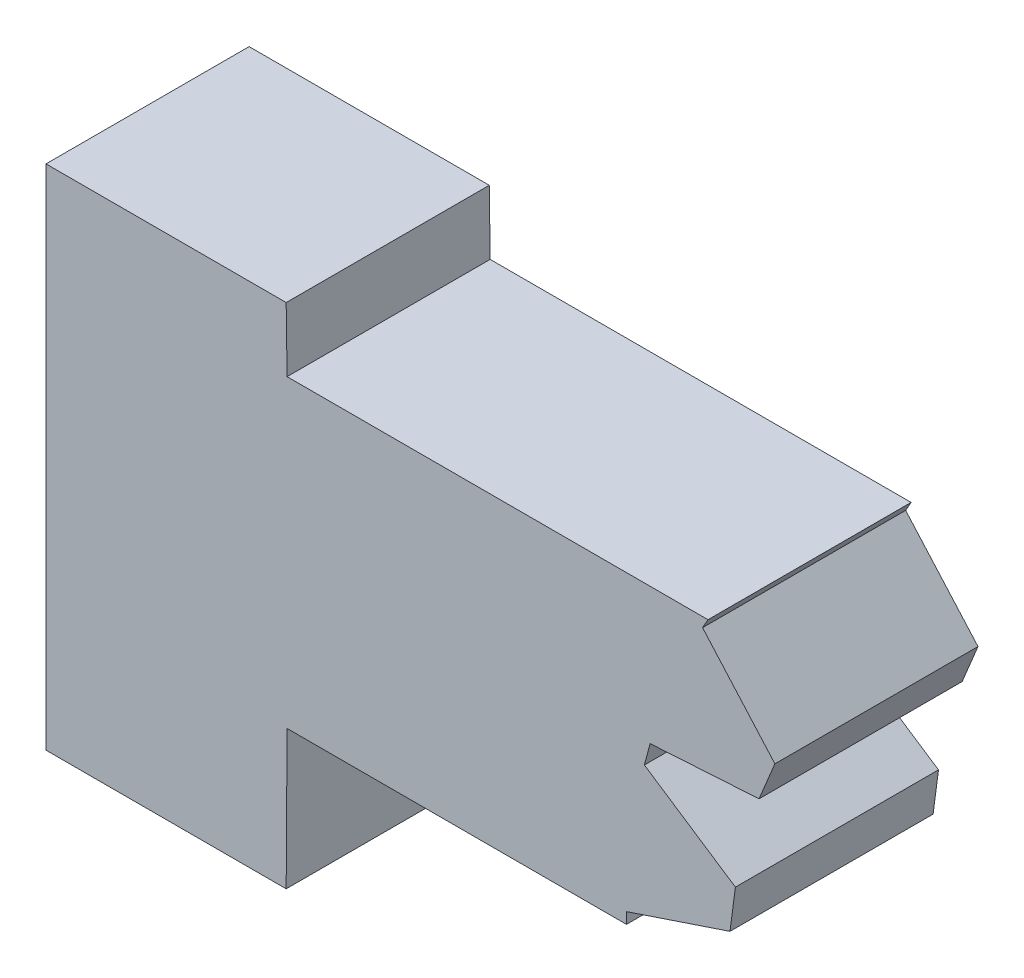
ISO-10303-21;
HEADER;
FILE_DESCRIPTION(('STEP AP214'),'2;1');
FILE_NAME('part.step','',(''),(''),'','','');
FILE_SCHEMA(('AUTOMOTIVE_DESIGN { 1 0 10303 214 1 1 1 1 }'));
ENDSEC;
DATA;
#1=APPLICATION_CONTEXT('core data for automotive mechanical design processes');
#2=APPLICATION_PROTOCOL_DEFINITION('international standard','automotive_design',2000,#1);
#3=PRODUCT_CONTEXT('',#1,'mechanical');
#4=PRODUCT('Part','Part','',(#3));
#5=PRODUCT_RELATED_PRODUCT_CATEGORY('part','',(#4));
#6=PRODUCT_DEFINITION_FORMATION('','',#4);
#7=PRODUCT_DEFINITION_CONTEXT('part definition',#1,'design');
#8=PRODUCT_DEFINITION('design','',#6,#7);
#9=PRODUCT_DEFINITION_SHAPE('','',#8);
#10=(LENGTH_UNIT() NAMED_UNIT(*) SI_UNIT(.MILLI.,.METRE.));
#11=(NAMED_UNIT(*) PLANE_ANGLE_UNIT() SI_UNIT($,.RADIAN.));
#12=(NAMED_UNIT(*) SI_UNIT($,.STERADIAN.) SOLID_ANGLE_UNIT());
#13=UNCERTAINTY_MEASURE_WITH_UNIT(LENGTH_MEASURE(1.E-05),#10,'distance_accuracy_value','');
#14=(GEOMETRIC_REPRESENTATION_CONTEXT(3) GLOBAL_UNCERTAINTY_ASSIGNED_CONTEXT((#13)) GLOBAL_UNIT_ASSIGNED_CONTEXT((#10,
#11,#12)) REPRESENTATION_CONTEXT('',''));
#15=CARTESIAN_POINT('',(0.,0.,0.));
#16=DIRECTION('',(0.,0.,1.));
#17=DIRECTION('',(1.,0.,0.));
#18=AXIS2_PLACEMENT_3D('',#15,#16,#17);
#19=CARTESIAN_POINT('',(12.9304605352733,8.55490384085248,4.));
#20=DIRECTION('',(-0.870533332407196,0.492109456491158,0.));
#21=DIRECTION('',(-0.492109456491158,-0.870533332407196,0.));
#22=AXIS2_PLACEMENT_3D('',#19,#20,#21);
#23=PLANE('',#22);
#24=DIRECTION('',(0.492109456491158,0.870533332407196,0.));
#25=VECTOR('',#24,1.);
#26=CARTESIAN_POINT('',(12.9304605352733,8.55490384085248,0.));
#27=LINE('',#26,#25);
#28=CARTESIAN_POINT('',(12.9304605352733,8.55490384085248,0.));
#29=VERTEX_POINT('',#28);
#30=CARTESIAN_POINT('',(13.0377837049311,8.74475671869166,0.));
#31=VERTEX_POINT('',#30);
#32=EDGE_CURVE('E177',#29,#31,#27,.T.);
#33=ORIENTED_EDGE('',*,*,#32,.T.);
#34=DIRECTION('',(0.,0.,-1.));
#35=VECTOR('',#34,1.);
#36=CARTESIAN_POINT('',(13.0377837049311,8.74475671869166,4.));
#37=LINE('',#36,#35);
#38=CARTESIAN_POINT('',(13.0377837049311,8.74475671869166,4.));
#39=VERTEX_POINT('',#38);
#40=EDGE_CURVE('E11',#39,#31,#37,.T.);
#41=ORIENTED_EDGE('',*,*,#40,.F.);
#42=DIRECTION('',(0.492109456491158,0.870533332407196,0.));
#43=VECTOR('',#42,1.);
#44=CARTESIAN_POINT('',(12.9304605352733,8.55490384085248,4.));
#45=LINE('',#44,#43);
#46=CARTESIAN_POINT('',(12.9304605352733,8.55490384085248,4.));
#47=VERTEX_POINT('',#46);
#48=EDGE_CURVE('E207',#47,#39,#45,.T.);
#49=ORIENTED_EDGE('',*,*,#48,.F.);
#50=DIRECTION('',(0.,0.,-1.));
#51=VECTOR('',#50,1.);
#52=CARTESIAN_POINT('',(12.9304605352733,8.55490384085248,4.));
#53=LINE('',#52,#51);
#54=EDGE_CURVE('E173',#47,#29,#53,.T.);
#55=ORIENTED_EDGE('',*,*,#54,.T.);
#56=EDGE_LOOP('',(#33,#41,#49,#55));
#57=FACE_BOUND('',#56,.T.);
#58=ADVANCED_FACE('F33',(#57),#23,.F.);
#59=CARTESIAN_POINT('',(4.74778370493112,8.74475671869166,4.));
#60=DIRECTION('',(0.,-1.,0.));
#61=DIRECTION('',(0.,0.,-1.));
#62=AXIS2_PLACEMENT_3D('',#59,#60,#61);
#63=PLANE('',#62);
#64=DIRECTION('',(-1.,0.,0.));
#65=VECTOR('',#64,1.);
#66=CARTESIAN_POINT('',(4.74778370493112,8.74475671869166,0.));
#67=LINE('',#66,#65);
#68=CARTESIAN_POINT('',(4.74778370493112,8.74475671869166,0.));
#69=VERTEX_POINT('',#68);
#70=EDGE_CURVE('E180',#31,#69,#67,.T.);
#71=ORIENTED_EDGE('',*,*,#70,.T.);
#72=DIRECTION('',(0.,0.,-1.));
#73=VECTOR('',#72,1.);
#74=CARTESIAN_POINT('',(4.74778370493112,8.74475671869166,4.));
#75=LINE('',#74,#73);
#76=CARTESIAN_POINT('',(4.74778370493112,8.74475671869166,4.));
#77=VERTEX_POINT('',#76);
#78=EDGE_CURVE('E41',#77,#69,#75,.T.);
#79=ORIENTED_EDGE('',*,*,#78,.F.);
#80=DIRECTION('',(-1.,0.,0.));
#81=VECTOR('',#80,1.);
#82=CARTESIAN_POINT('',(4.74778370493112,8.74475671869166,4.));
#83=LINE('',#82,#81);
#84=EDGE_CURVE('E116',#39,#77,#83,.T.);
#85=ORIENTED_EDGE('',*,*,#84,.F.);
#86=ORIENTED_EDGE('',*,*,#40,.T.);
#87=EDGE_LOOP('',(#71,#79,#85,#86));
#88=FACE_BOUND('',#87,.T.);
#89=ADVANCED_FACE('F305',(#88),#63,.F.);
#90=CARTESIAN_POINT('',(4.73,10.,4.));
#91=DIRECTION('',(-0.999899655561117,-0.01416611480819,0.));
#92=DIRECTION('',(0.01416611480819,-0.999899655561117,0.));
#93=AXIS2_PLACEMENT_3D('',#90,#91,#92);
#94=PLANE('',#93);
#95=DIRECTION('',(-0.01416611480819,0.999899655561117,0.));
#96=VECTOR('',#95,1.);
#97=CARTESIAN_POINT('',(4.73,10.,0.));
#98=LINE('',#97,#96);
#99=CARTESIAN_POINT('',(4.73,10.,0.));
#100=VERTEX_POINT('',#99);
#101=EDGE_CURVE('E182',#69,#100,#98,.T.);
#102=ORIENTED_EDGE('',*,*,#101,.T.);
#103=DIRECTION('',(0.,0.,-1.));
#104=VECTOR('',#103,1.);
#105=CARTESIAN_POINT('',(4.73,10.,4.));
#106=LINE('',#105,#104);
#107=CARTESIAN_POINT('',(4.73,10.,4.));
#108=VERTEX_POINT('',#107);
#109=EDGE_CURVE('E238',#108,#100,#106,.T.);
#110=ORIENTED_EDGE('',*,*,#109,.F.);
#111=DIRECTION('',(-0.01416611480819,0.999899655561117,0.));
#112=VECTOR('',#111,1.);
#113=CARTESIAN_POINT('',(4.73,10.,4.));
#114=LINE('',#113,#112);
#115=EDGE_CURVE('E246',#77,#108,#114,.T.);
#116=ORIENTED_EDGE('',*,*,#115,.F.);
#117=ORIENTED_EDGE('',*,*,#78,.T.);
#118=EDGE_LOOP('',(#102,#110,#116,#117));
#119=FACE_BOUND('',#118,.T.);
#120=ADVANCED_FACE('F244',(#119),#94,.F.);
#121=CARTESIAN_POINT('',(4.73,10.,4.));
#122=DIRECTION('',(0.,-1.,0.));
#123=DIRECTION('',(0.,0.,-1.));
#124=AXIS2_PLACEMENT_3D('',#121,#122,#123);
#125=PLANE('',#124);
#126=DIRECTION('',(-1.,0.,0.));
#127=VECTOR('',#126,1.);
#128=CARTESIAN_POINT('',(4.73,10.,0.));
#129=LINE('',#128,#127);
#130=CARTESIAN_POINT('',(0.,10.,0.));
#131=VERTEX_POINT('',#130);
#132=EDGE_CURVE('E184',#100,#131,#129,.T.);
#133=ORIENTED_EDGE('',*,*,#132,.T.);
#134=DIRECTION('',(0.,0.,-1.));
#135=VECTOR('',#134,1.);
#136=CARTESIAN_POINT('',(0.,10.,4.));
#137=LINE('',#136,#135);
#138=CARTESIAN_POINT('',(0.,10.,4.));
#139=VERTEX_POINT('',#138);
#140=EDGE_CURVE('E235',#139,#131,#137,.T.);
#141=ORIENTED_EDGE('',*,*,#140,.F.);
#142=DIRECTION('',(-1.,0.,0.));
#143=VECTOR('',#142,1.);
#144=CARTESIAN_POINT('',(4.73,10.,4.));
#145=LINE('',#144,#143);
#146=EDGE_CURVE('E264',#108,#139,#145,.T.);
#147=ORIENTED_EDGE('',*,*,#146,.F.);
#148=ORIENTED_EDGE('',*,*,#109,.T.);
#149=EDGE_LOOP('',(#133,#141,#147,#148));
#150=FACE_BOUND('',#149,.T.);
#151=ADVANCED_FACE('F255',(#150),#125,.F.);
#152=CARTESIAN_POINT('',(0.,0.,4.));
#153=DIRECTION('',(1.,0.,0.));
#154=DIRECTION('',(0.,0.,-1.));
#155=AXIS2_PLACEMENT_3D('',#152,#153,#154);
#156=PLANE('',#155);
#157=DIRECTION('',(0.,-1.,0.));
#158=VECTOR('',#157,1.);
#159=CARTESIAN_POINT('',(0.,0.,0.));
#160=LINE('',#159,#158);
#161=CARTESIAN_POINT('',(0.,0.,0.));
#162=VERTEX_POINT('',#161);
#163=EDGE_CURVE('E186',#131,#162,#160,.T.);
#164=ORIENTED_EDGE('',*,*,#163,.T.);
#165=DIRECTION('',(0.,0.,-1.));
#166=VECTOR('',#165,1.);
#167=CARTESIAN_POINT('',(0.,0.,4.));
#168=LINE('',#167,#166);
#169=CARTESIAN_POINT('',(0.,0.,4.));
#170=VERTEX_POINT('',#169);
#171=EDGE_CURVE('E232',#170,#162,#168,.T.);
#172=ORIENTED_EDGE('',*,*,#171,.F.);
#173=DIRECTION('',(0.,-1.,0.));
#174=VECTOR('',#173,1.);
#175=CARTESIAN_POINT('',(0.,0.,4.));
#176=LINE('',#175,#174);
#177=EDGE_CURVE('E261',#139,#170,#176,.T.);
#178=ORIENTED_EDGE('',*,*,#177,.F.);
#179=ORIENTED_EDGE('',*,*,#140,.T.);
#180=EDGE_LOOP('',(#164,#172,#178,#179));
#181=FACE_BOUND('',#180,.T.);
#182=ADVANCED_FACE('F259',(#181),#156,.F.);
#183=CARTESIAN_POINT('',(4.73,0.,4.));
#184=DIRECTION('',(0.,1.,0.));
#185=DIRECTION('',(0.,0.,1.));
#186=AXIS2_PLACEMENT_3D('',#183,#184,#185);
#187=PLANE('',#186);
#188=DIRECTION('',(1.,0.,0.));
#189=VECTOR('',#188,1.);
#190=CARTESIAN_POINT('',(4.73,0.,0.));
#191=LINE('',#190,#189);
#192=CARTESIAN_POINT('',(4.73,0.,0.));
#193=VERTEX_POINT('',#192);
#194=EDGE_CURVE('E188',#162,#193,#191,.T.);
#195=ORIENTED_EDGE('',*,*,#194,.T.);
#196=DIRECTION('',(0.,0.,-1.));
#197=VECTOR('',#196,1.);
#198=CARTESIAN_POINT('',(4.73,0.,4.));
#199=LINE('',#198,#197);
#200=CARTESIAN_POINT('',(4.73,0.,4.));
#201=VERTEX_POINT('',#200);
#202=EDGE_CURVE('E229',#201,#193,#199,.T.);
#203=ORIENTED_EDGE('',*,*,#202,.F.);
#204=DIRECTION('',(1.,0.,0.));
#205=VECTOR('',#204,1.);
#206=CARTESIAN_POINT('',(4.73,0.,4.));
#207=LINE('',#206,#205);
#208=EDGE_CURVE('E263',#170,#201,#207,.T.);
#209=ORIENTED_EDGE('',*,*,#208,.F.);
#210=ORIENTED_EDGE('',*,*,#171,.T.);
#211=EDGE_LOOP('',(#195,#203,#209,#210));
#212=FACE_BOUND('',#211,.T.);
#213=ADVANCED_FACE('F318',(#212),#187,.F.);
#214=CARTESIAN_POINT('',(4.74778370493112,2.74476455823996,4.));
#215=DIRECTION('',(-0.999979011054282,0.00647900076402233,0.));
#216=DIRECTION('',(-0.00647900076402233,-0.999979011054282,0.));
#217=AXIS2_PLACEMENT_3D('',#214,#215,#216);
#218=PLANE('',#217);
#219=DIRECTION('',(0.00647900076402233,0.999979011054282,0.));
#220=VECTOR('',#219,1.);
#221=CARTESIAN_POINT('',(4.74778370493112,2.74476455823996,0.));
#222=LINE('',#221,#220);
#223=CARTESIAN_POINT('',(4.74778370493112,2.74476455823996,0.));
#224=VERTEX_POINT('',#223);
#225=EDGE_CURVE('E190',#193,#224,#222,.T.);
#226=ORIENTED_EDGE('',*,*,#225,.T.);
#227=DIRECTION('',(0.,0.,-1.));
#228=VECTOR('',#227,1.);
#229=CARTESIAN_POINT('',(4.74778370493112,2.74476455823996,4.));
#230=LINE('',#229,#228);
#231=CARTESIAN_POINT('',(4.74778370493112,2.74476455823996,4.));
#232=VERTEX_POINT('',#231);
#233=EDGE_CURVE('E226',#232,#224,#230,.T.);
#234=ORIENTED_EDGE('',*,*,#233,.F.);
#235=DIRECTION('',(0.00647900076402233,0.999979011054282,0.));
#236=VECTOR('',#235,1.);
#237=CARTESIAN_POINT('',(4.74778370493112,2.74476455823996,4.));
#238=LINE('',#237,#236);
#239=EDGE_CURVE('E266',#201,#232,#238,.T.);
#240=ORIENTED_EDGE('',*,*,#239,.F.);
#241=ORIENTED_EDGE('',*,*,#202,.T.);
#242=EDGE_LOOP('',(#226,#234,#240,#241));
#243=FACE_BOUND('',#242,.T.);
#244=ADVANCED_FACE('F321',(#243),#218,.F.);
#245=CARTESIAN_POINT('',(4.74778370493112,2.74476455823996,4.));
#246=DIRECTION('',(0.,1.,0.));
#247=DIRECTION('',(0.,0.,1.));
#248=AXIS2_PLACEMENT_3D('',#245,#246,#247);
#249=PLANE('',#248);
#250=DIRECTION('',(1.,0.,0.));
#251=VECTOR('',#250,1.);
#252=CARTESIAN_POINT('',(4.74778370493112,2.74476455823996,0.));
#253=LINE('',#252,#251);
#254=CARTESIAN_POINT('',(11.4320749114308,2.74476455823996,0.));
#255=VERTEX_POINT('',#254);
#256=EDGE_CURVE('E192',#224,#255,#253,.T.);
#257=ORIENTED_EDGE('',*,*,#256,.T.);
#258=DIRECTION('',(0.,0.,-1.));
#259=VECTOR('',#258,1.);
#260=CARTESIAN_POINT('',(11.4320749114308,2.74476455823996,4.));
#261=LINE('',#260,#259);
#262=CARTESIAN_POINT('',(11.4320749114308,2.74476455823996,4.));
#263=VERTEX_POINT('',#262);
#264=EDGE_CURVE('E223',#263,#255,#261,.T.);
#265=ORIENTED_EDGE('',*,*,#264,.F.);
#266=DIRECTION('',(1.,0.,0.));
#267=VECTOR('',#266,1.);
#268=CARTESIAN_POINT('',(4.74778370493112,2.74476455823996,4.));
#269=LINE('',#268,#267);
#270=EDGE_CURVE('E272',#232,#263,#269,.T.);
#271=ORIENTED_EDGE('',*,*,#270,.F.);
#272=ORIENTED_EDGE('',*,*,#233,.T.);
#273=EDGE_LOOP('',(#257,#265,#271,#272));
#274=FACE_BOUND('',#273,.T.);
#275=ADVANCED_FACE('F325',(#274),#249,.F.);
#276=CARTESIAN_POINT('',(11.4320749114308,2.74476455823996,4.));
#277=DIRECTION('',(-1.,0.,0.));
#278=DIRECTION('',(0.,0.,1.));
#279=AXIS2_PLACEMENT_3D('',#276,#277,#278);
#280=PLANE('',#279);
#281=DIRECTION('',(0.,1.,0.));
#282=VECTOR('',#281,1.);
#283=CARTESIAN_POINT('',(11.4320749114308,2.74476455823996,0.));
#284=LINE('',#283,#282);
#285=CARTESIAN_POINT('',(11.4320749114308,2.96285256334162,0.));
#286=VERTEX_POINT('',#285);
#287=EDGE_CURVE('E194',#255,#286,#284,.T.);
#288=ORIENTED_EDGE('',*,*,#287,.T.);
#289=DIRECTION('',(0.,0.,-1.));
#290=VECTOR('',#289,1.);
#291=CARTESIAN_POINT('',(11.4320749114308,2.96285256334162,4.));
#292=LINE('',#291,#290);
#293=CARTESIAN_POINT('',(11.4320749114308,2.96285256334162,4.));
#294=VERTEX_POINT('',#293);
#295=EDGE_CURVE('E220',#294,#286,#292,.T.);
#296=ORIENTED_EDGE('',*,*,#295,.F.);
#297=DIRECTION('',(0.,1.,0.));
#298=VECTOR('',#297,1.);
#299=CARTESIAN_POINT('',(11.4320749114308,2.74476455823996,4.));
#300=LINE('',#299,#298);
#301=EDGE_CURVE('E274',#263,#294,#300,.T.);
#302=ORIENTED_EDGE('',*,*,#301,.F.);
#303=ORIENTED_EDGE('',*,*,#264,.T.);
#304=EDGE_LOOP('',(#288,#296,#302,#303));
#305=FACE_BOUND('',#304,.T.);
#306=ADVANCED_FACE('F329',(#305),#280,.F.);
#307=CARTESIAN_POINT('',(11.4320749114308,2.96285256334162,4.));
#308=DIRECTION('',(-0.31722342524605,0.948350830903397,0.));
#309=DIRECTION('',(-0.948350830903397,-0.31722342524605,0.));
#310=AXIS2_PLACEMENT_3D('',#307,#308,#309);
#311=PLANE('',#310);
#312=DIRECTION('',(0.948350830903397,0.31722342524605,0.));
#313=VECTOR('',#312,1.);
#314=CARTESIAN_POINT('',(11.4320749114308,2.96285256334162,0.));
#315=LINE('',#314,#313);
#316=CARTESIAN_POINT('',(13.4706753283553,3.64476455823994,0.));
#317=VERTEX_POINT('',#316);
#318=EDGE_CURVE('E196',#286,#317,#315,.T.);
#319=ORIENTED_EDGE('',*,*,#318,.T.);
#320=DIRECTION('',(0.,0.,-1.));
#321=VECTOR('',#320,1.);
#322=CARTESIAN_POINT('',(13.4706753283553,3.64476455823994,4.));
#323=LINE('',#322,#321);
#324=CARTESIAN_POINT('',(13.4706753283553,3.64476455823994,4.));
#325=VERTEX_POINT('',#324);
#326=EDGE_CURVE('E217',#325,#317,#323,.T.);
#327=ORIENTED_EDGE('',*,*,#326,.F.);
#328=DIRECTION('',(0.948350830903397,0.31722342524605,0.));
#329=VECTOR('',#328,1.);
#330=CARTESIAN_POINT('',(11.4320749114308,2.96285256334162,4.));
#331=LINE('',#330,#329);
#332=EDGE_CURVE('E276',#294,#325,#331,.T.);
#333=ORIENTED_EDGE('',*,*,#332,.F.);
#334=ORIENTED_EDGE('',*,*,#295,.T.);
#335=EDGE_LOOP('',(#319,#327,#333,#334));
#336=FACE_BOUND('',#335,.T.);
#337=ADVANCED_FACE('F333',(#336),#311,.F.);
#338=CARTESIAN_POINT('',(13.4706753283553,3.64476455823994,4.));
#339=DIRECTION('',(-0.991444861373811,0.130526192220048,0.));
#340=DIRECTION('',(-0.130526192220048,-0.991444861373811,0.));
#341=AXIS2_PLACEMENT_3D('',#338,#339,#340);
#342=PLANE('',#341);
#343=DIRECTION('',(0.130526192220048,0.991444861373811,0.));
#344=VECTOR('',#343,1.);
#345=CARTESIAN_POINT('',(13.4706753283553,3.64476455823994,0.));
#346=LINE('',#345,#344);
#347=CARTESIAN_POINT('',(13.5770971149535,4.45311828147681,0.));
#348=VERTEX_POINT('',#347);
#349=EDGE_CURVE('E198',#317,#348,#346,.T.);
#350=ORIENTED_EDGE('',*,*,#349,.T.);
#351=DIRECTION('',(0.,0.,-1.));
#352=VECTOR('',#351,1.);
#353=CARTESIAN_POINT('',(13.5770971149535,4.45311828147681,4.));
#354=LINE('',#353,#352);
#355=CARTESIAN_POINT('',(13.5770971149535,4.45311828147681,4.));
#356=VERTEX_POINT('',#355);
#357=EDGE_CURVE('E214',#356,#348,#354,.T.);
#358=ORIENTED_EDGE('',*,*,#357,.F.);
#359=DIRECTION('',(0.130526192220048,0.991444861373811,0.));
#360=VECTOR('',#359,1.);
#361=CARTESIAN_POINT('',(13.4706753283553,3.64476455823994,4.));
#362=LINE('',#361,#360);
#363=EDGE_CURVE('E278',#325,#356,#362,.T.);
#364=ORIENTED_EDGE('',*,*,#363,.F.);
#365=ORIENTED_EDGE('',*,*,#326,.T.);
#366=EDGE_LOOP('',(#350,#358,#364,#365));
#367=FACE_BOUND('',#366,.T.);
#368=ADVANCED_FACE('F337',(#367),#342,.F.);
#369=CARTESIAN_POINT('',(13.5770971149535,4.45311828147681,4.));
#370=DIRECTION('',(-0.551865555625634,-0.833933095945958,0.));
#371=DIRECTION('',(0.833933095945958,-0.551865555625634,0.));
#372=AXIS2_PLACEMENT_3D('',#369,#370,#371);
#373=PLANE('',#372);
#374=DIRECTION('',(-0.833933095945958,0.551865555625634,0.));
#375=VECTOR('',#374,1.);
#376=CARTESIAN_POINT('',(13.5770971149535,4.45311828147681,0.));
#377=LINE('',#376,#375);
#378=CARTESIAN_POINT('',(11.784452134126,5.63942330185938,0.));
#379=VERTEX_POINT('',#378);
#380=EDGE_CURVE('E200',#348,#379,#377,.T.);
#381=ORIENTED_EDGE('',*,*,#380,.T.);
#382=DIRECTION('',(0.,0.,-1.));
#383=VECTOR('',#382,1.);
#384=CARTESIAN_POINT('',(11.784452134126,5.63942330185938,4.));
#385=LINE('',#384,#383);
#386=CARTESIAN_POINT('',(11.784452134126,5.63942330185938,4.));
#387=VERTEX_POINT('',#386);
#388=EDGE_CURVE('E211',#387,#379,#385,.T.);
#389=ORIENTED_EDGE('',*,*,#388,.F.);
#390=DIRECTION('',(-0.833933095945958,0.551865555625634,0.));
#391=VECTOR('',#390,1.);
#392=CARTESIAN_POINT('',(13.5770971149535,4.45311828147681,4.));
#393=LINE('',#392,#391);
#394=EDGE_CURVE('E280',#356,#387,#393,.T.);
#395=ORIENTED_EDGE('',*,*,#394,.F.);
#396=ORIENTED_EDGE('',*,*,#357,.T.);
#397=EDGE_LOOP('',(#381,#389,#395,#396));
#398=FACE_BOUND('',#397,.T.);
#399=ADVANCED_FACE('F286',(#398),#373,.F.);
#400=CARTESIAN_POINT('',(11.784452134126,5.63942330185938,4.));
#401=DIRECTION('',(-0.965925826289063,0.258819045102539,0.));
#402=DIRECTION('',(-0.258819045102539,-0.965925826289063,0.));
#403=AXIS2_PLACEMENT_3D('',#400,#401,#402);
#404=PLANE('',#403);
#405=DIRECTION('',(0.258819045102539,0.965925826289064,0.));
#406=VECTOR('',#405,1.);
#407=CARTESIAN_POINT('',(11.784452134126,5.63942330185938,0.));
#408=LINE('',#407,#406);
#409=CARTESIAN_POINT('',(11.8973427925835,6.06073697492256,0.));
#410=VERTEX_POINT('',#409);
#411=EDGE_CURVE('E202',#379,#410,#408,.T.);
#412=ORIENTED_EDGE('',*,*,#411,.T.);
#413=DIRECTION('',(0.,0.,-1.));
#414=VECTOR('',#413,1.);
#415=CARTESIAN_POINT('',(11.8973427925835,6.06073697492256,4.));
#416=LINE('',#415,#414);
#417=CARTESIAN_POINT('',(11.8973427925835,6.06073697492256,4.));
#418=VERTEX_POINT('',#417);
#419=EDGE_CURVE('E168',#418,#410,#416,.T.);
#420=ORIENTED_EDGE('',*,*,#419,.F.);
#421=DIRECTION('',(0.258819045102539,0.965925826289064,0.));
#422=VECTOR('',#421,1.);
#423=CARTESIAN_POINT('',(11.784452134126,5.63942330185938,4.));
#424=LINE('',#423,#422);
#425=EDGE_CURVE('E159',#387,#418,#424,.T.);
#426=ORIENTED_EDGE('',*,*,#425,.F.);
#427=ORIENTED_EDGE('',*,*,#388,.T.);
#428=EDGE_LOOP('',(#412,#420,#426,#427));
#429=FACE_BOUND('',#428,.T.);
#430=ADVANCED_FACE('F290',(#429),#404,.F.);
#431=CARTESIAN_POINT('',(11.8973427925835,6.06073697492256,4.));
#432=DIRECTION('',(-0.060963042672375,0.998140023958626,0.));
#433=DIRECTION('',(-0.998140023958626,-0.060963042672375,0.));
#434=AXIS2_PLACEMENT_3D('',#431,#432,#433);
#435=PLANE('',#434);
#436=DIRECTION('',(0.998140023958626,0.060963042672375,0.));
#437=VECTOR('',#436,1.);
#438=CARTESIAN_POINT('',(11.8973427925835,6.06073697492256,0.));
#439=LINE('',#438,#437);
#440=CARTESIAN_POINT('',(14.0429713961381,6.19178476879701,0.));
#441=VERTEX_POINT('',#440);
#442=EDGE_CURVE('E167',#410,#441,#439,.T.);
#443=ORIENTED_EDGE('',*,*,#442,.T.);
#444=DIRECTION('',(0.,0.,-1.));
#445=VECTOR('',#444,1.);
#446=CARTESIAN_POINT('',(14.0429713961381,6.19178476879701,4.));
#447=LINE('',#446,#445);
#448=CARTESIAN_POINT('',(14.0429713961381,6.19178476879701,4.));
#449=VERTEX_POINT('',#448);
#450=EDGE_CURVE('E164',#449,#441,#447,.T.);
#451=ORIENTED_EDGE('',*,*,#450,.F.);
#452=DIRECTION('',(0.998140023958626,0.060963042672375,0.));
#453=VECTOR('',#452,1.);
#454=CARTESIAN_POINT('',(11.8973427925835,6.06073697492256,4.));
#455=LINE('',#454,#453);
#456=EDGE_CURVE('E153',#418,#449,#455,.T.);
#457=ORIENTED_EDGE('',*,*,#456,.F.);
#458=ORIENTED_EDGE('',*,*,#419,.T.);
#459=EDGE_LOOP('',(#443,#451,#457,#458));
#460=FACE_BOUND('',#459,.T.);
#461=ADVANCED_FACE('F165',(#460),#435,.F.);
#462=CARTESIAN_POINT('',(14.0429713961381,6.19178476879701,4.));
#463=DIRECTION('',(-0.923879532511289,0.382683432365085,0.));
#464=DIRECTION('',(-0.382683432365085,-0.923879532511289,0.));
#465=AXIS2_PLACEMENT_3D('',#462,#463,#464);
#466=PLANE('',#465);
#467=DIRECTION('',(0.382683432365085,0.923879532511289,0.));
#468=VECTOR('',#467,1.);
#469=CARTESIAN_POINT('',(14.0429713961381,6.19178476879701,0.));
#470=LINE('',#469,#468);
#471=CARTESIAN_POINT('',(14.3549842870463,6.94505052166298,0.));
#472=VERTEX_POINT('',#471);
#473=EDGE_CURVE('E102',#441,#472,#470,.T.);
#474=ORIENTED_EDGE('',*,*,#473,.T.);
#475=DIRECTION('',(0.,0.,-1.));
#476=VECTOR('',#475,1.);
#477=CARTESIAN_POINT('',(14.3549842870463,6.94505052166298,4.));
#478=LINE('',#477,#476);
#479=CARTESIAN_POINT('',(14.3549842870463,6.94505052166298,4.));
#480=VERTEX_POINT('',#479);
#481=EDGE_CURVE('E169',#480,#472,#478,.T.);
#482=ORIENTED_EDGE('',*,*,#481,.F.);
#483=DIRECTION('',(0.382683432365085,0.923879532511289,0.));
#484=VECTOR('',#483,1.);
#485=CARTESIAN_POINT('',(14.0429713961381,6.19178476879701,4.));
#486=LINE('',#485,#484);
#487=EDGE_CURVE('E157',#449,#480,#486,.T.);
#488=ORIENTED_EDGE('',*,*,#487,.F.);
#489=ORIENTED_EDGE('',*,*,#450,.T.);
#490=EDGE_LOOP('',(#474,#482,#488,#489));
#491=FACE_BOUND('',#490,.T.);
#492=ADVANCED_FACE('F171',(#491),#466,.F.);
#493=CARTESIAN_POINT('',(14.3549842870463,6.94505052166298,4.));
#494=DIRECTION('',(-0.748898960390284,-0.662684198639406,0.));
#495=DIRECTION('',(0.662684198639406,-0.748898960390284,0.));
#496=AXIS2_PLACEMENT_3D('',#493,#494,#495);
#497=PLANE('',#496);
#498=DIRECTION('',(-0.662684198639406,0.748898960390284,0.));
#499=VECTOR('',#498,1.);
#500=CARTESIAN_POINT('',(14.3549842870463,6.94505052166298,0.));
#501=LINE('',#500,#499);
#502=EDGE_CURVE('E108',#472,#29,#501,.T.);
#503=ORIENTED_EDGE('',*,*,#502,.T.);
#504=ORIENTED_EDGE('',*,*,#54,.F.);
#505=DIRECTION('',(-0.662684198639406,0.748898960390284,0.));
#506=VECTOR('',#505,1.);
#507=CARTESIAN_POINT('',(14.3549842870463,6.94505052166298,4.));
#508=LINE('',#507,#506);
#509=EDGE_CURVE('E49',#480,#47,#508,.T.);
#510=ORIENTED_EDGE('',*,*,#509,.F.);
#511=ORIENTED_EDGE('',*,*,#481,.T.);
#512=EDGE_LOOP('',(#503,#504,#510,#511));
#513=FACE_BOUND('',#512,.T.);
#514=ADVANCED_FACE('F294',(#513),#497,.F.);
#515=CARTESIAN_POINT('',(0.,0.,4.));
#516=DIRECTION('',(0.,0.,1.));
#517=DIRECTION('',(1.,0.,0.));
#518=AXIS2_PLACEMENT_3D('',#515,#516,#517);
#519=PLANE('',#518);
#520=ORIENTED_EDGE('',*,*,#48,.T.);
#521=ORIENTED_EDGE('',*,*,#84,.T.);
#522=ORIENTED_EDGE('',*,*,#115,.T.);
#523=ORIENTED_EDGE('',*,*,#146,.T.);
#524=ORIENTED_EDGE('',*,*,#177,.T.);
#525=ORIENTED_EDGE('',*,*,#208,.T.);
#526=ORIENTED_EDGE('',*,*,#239,.T.);
#527=ORIENTED_EDGE('',*,*,#270,.T.);
#528=ORIENTED_EDGE('',*,*,#301,.T.);
#529=ORIENTED_EDGE('',*,*,#332,.T.);
#530=ORIENTED_EDGE('',*,*,#363,.T.);
#531=ORIENTED_EDGE('',*,*,#394,.T.);
#532=ORIENTED_EDGE('',*,*,#425,.T.);
#533=ORIENTED_EDGE('',*,*,#456,.T.);
#534=ORIENTED_EDGE('',*,*,#487,.T.);
#535=ORIENTED_EDGE('',*,*,#509,.T.);
#536=EDGE_LOOP('',(#520,#521,#522,#523,#524,#525,#526,#527,#528,#529,#530,#531,#532,#533,#534,#535));
#537=FACE_BOUND('',#536,.T.);
#538=ADVANCED_FACE('F155',(#537),#519,.T.);
#539=CARTESIAN_POINT('',(0.,0.,0.));
#540=DIRECTION('',(0.,0.,1.));
#541=DIRECTION('',(1.,0.,0.));
#542=AXIS2_PLACEMENT_3D('',#539,#540,#541);
#543=PLANE('',#542);
#544=ORIENTED_EDGE('',*,*,#32,.F.);
#545=ORIENTED_EDGE('',*,*,#502,.F.);
#546=ORIENTED_EDGE('',*,*,#473,.F.);
#547=ORIENTED_EDGE('',*,*,#442,.F.);
#548=ORIENTED_EDGE('',*,*,#411,.F.);
#549=ORIENTED_EDGE('',*,*,#380,.F.);
#550=ORIENTED_EDGE('',*,*,#349,.F.);
#551=ORIENTED_EDGE('',*,*,#318,.F.);
#552=ORIENTED_EDGE('',*,*,#287,.F.);
#553=ORIENTED_EDGE('',*,*,#256,.F.);
#554=ORIENTED_EDGE('',*,*,#225,.F.);
#555=ORIENTED_EDGE('',*,*,#194,.F.);
#556=ORIENTED_EDGE('',*,*,#163,.F.);
#557=ORIENTED_EDGE('',*,*,#132,.F.);
#558=ORIENTED_EDGE('',*,*,#101,.F.);
#559=ORIENTED_EDGE('',*,*,#70,.F.);
#560=EDGE_LOOP('',(#544,#545,#546,#547,#548,#549,#550,#551,#552,#553,#554,#555,#556,#557,#558,#559));
#561=FACE_BOUND('',#560,.T.);
#562=ADVANCED_FACE('F250',(#561),#543,.F.);
#563=CLOSED_SHELL('',(#58,#89,#120,#151,#182,#213,#244,#275,#306,#337,#368,#399,#430,#461,#492,
#514,#538,#562));
#564=MANIFOLD_SOLID_BREP('B2',#563);
#565=ADVANCED_BREP_SHAPE_REPRESENTATION('',(#18,#564),#14);
#566=SHAPE_DEFINITION_REPRESENTATION(#9,#565);
ENDSEC;
END-ISO-10303-21;
